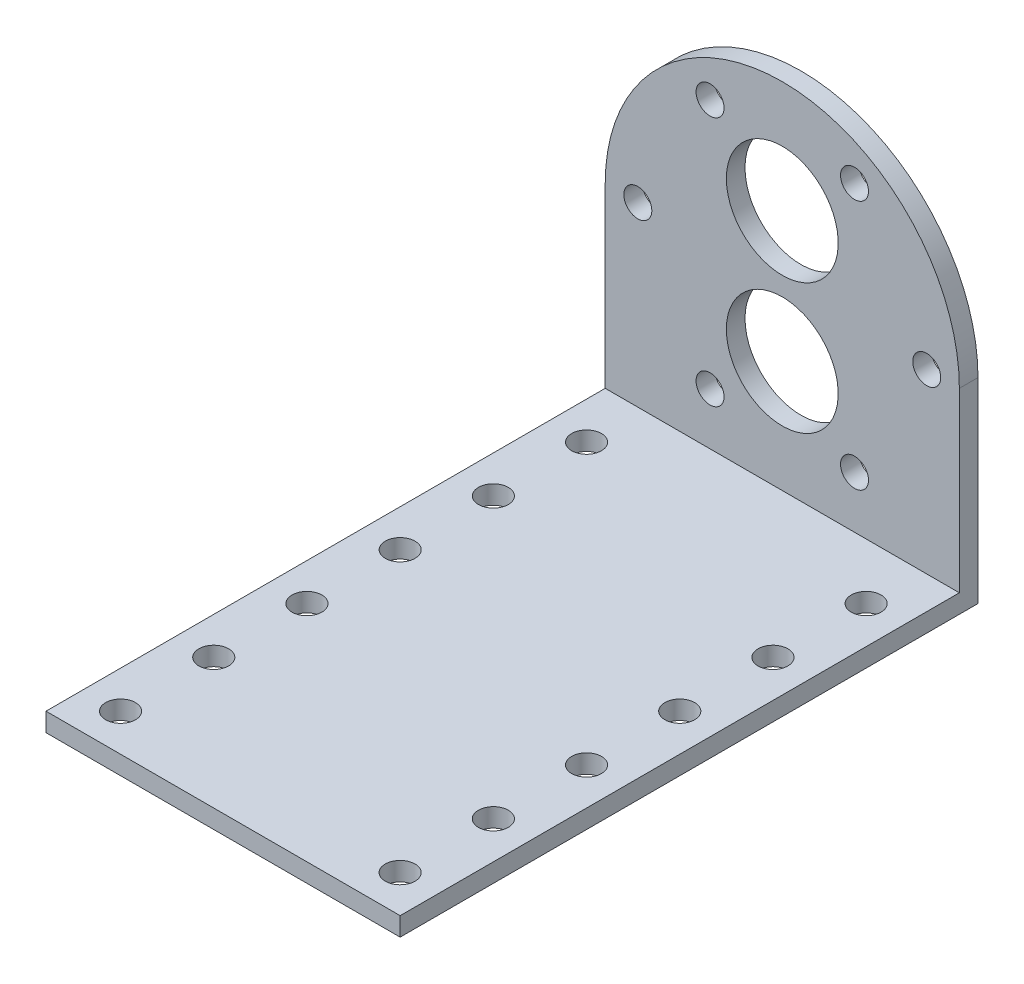
ISO-10303-21;
HEADER;
FILE_DESCRIPTION(('STEP AP214'),'2;1');
FILE_NAME('part.step','',(''),(''),'','','');
FILE_SCHEMA(('AUTOMOTIVE_DESIGN { 1 0 10303 214 1 1 1 1 }'));
ENDSEC;
DATA;
#1=APPLICATION_CONTEXT('core data for automotive mechanical design processes');
#2=APPLICATION_PROTOCOL_DEFINITION('international standard','automotive_design',2000,#1);
#3=PRODUCT_CONTEXT('',#1,'mechanical');
#4=PRODUCT('Part','Part','',(#3));
#5=PRODUCT_RELATED_PRODUCT_CATEGORY('part','',(#4));
#6=PRODUCT_DEFINITION_FORMATION('','',#4);
#7=PRODUCT_DEFINITION_CONTEXT('part definition',#1,'design');
#8=PRODUCT_DEFINITION('design','',#6,#7);
#9=PRODUCT_DEFINITION_SHAPE('','',#8);
#10=(LENGTH_UNIT() NAMED_UNIT(*) SI_UNIT(.MILLI.,.METRE.));
#11=(NAMED_UNIT(*) PLANE_ANGLE_UNIT() SI_UNIT($,.RADIAN.));
#12=(NAMED_UNIT(*) SI_UNIT($,.STERADIAN.) SOLID_ANGLE_UNIT());
#13=UNCERTAINTY_MEASURE_WITH_UNIT(LENGTH_MEASURE(1.E-05),#10,'distance_accuracy_value','');
#14=(GEOMETRIC_REPRESENTATION_CONTEXT(3) GLOBAL_UNCERTAINTY_ASSIGNED_CONTEXT((#13)) GLOBAL_UNIT_ASSIGNED_CONTEXT((#10,
#11,#12)) REPRESENTATION_CONTEXT('',''));
#15=CARTESIAN_POINT('',(0.,0.,0.));
#16=DIRECTION('',(0.,0.,1.));
#17=DIRECTION('',(1.,0.,0.));
#18=AXIS2_PLACEMENT_3D('',#15,#16,#17);
#19=CARTESIAN_POINT('',(0.,0.,2.));
#20=DIRECTION('',(0.,0.,-1.));
#21=DIRECTION('',(-1.,0.,0.));
#22=AXIS2_PLACEMENT_3D('',#19,#20,#21);
#23=CYLINDRICAL_SURFACE('',#22,19.);
#24=CARTESIAN_POINT('',(0.,0.,0.));
#25=DIRECTION('',(0.,0.,1.));
#26=DIRECTION('',(1.,0.,0.));
#27=AXIS2_PLACEMENT_3D('',#24,#25,#26);
#28=CIRCLE('',#27,19.);
#29=CARTESIAN_POINT('',(19.,0.,0.));
#30=VERTEX_POINT('',#29);
#31=CARTESIAN_POINT('',(-19.,0.,0.));
#32=VERTEX_POINT('',#31);
#33=EDGE_CURVE('E94',#30,#32,#28,.T.);
#34=ORIENTED_EDGE('',*,*,#33,.T.);
#35=DIRECTION('',(0.,0.,-1.));
#36=VECTOR('',#35,1.);
#37=CARTESIAN_POINT('',(-19.,0.,2.));
#38=LINE('',#37,#36);
#39=CARTESIAN_POINT('',(-19.,0.,2.));
#40=VERTEX_POINT('',#39);
#41=EDGE_CURVE('E11',#40,#32,#38,.T.);
#42=ORIENTED_EDGE('',*,*,#41,.F.);
#43=CARTESIAN_POINT('',(0.,0.,2.));
#44=DIRECTION('',(0.,0.,1.));
#45=DIRECTION('',(1.,0.,0.));
#46=AXIS2_PLACEMENT_3D('',#43,#44,#45);
#47=CIRCLE('',#46,19.);
#48=CARTESIAN_POINT('',(19.,0.,2.));
#49=VERTEX_POINT('',#48);
#50=EDGE_CURVE('E88',#49,#40,#47,.T.);
#51=ORIENTED_EDGE('',*,*,#50,.F.);
#52=DIRECTION('',(0.,0.,-1.));
#53=VECTOR('',#52,1.);
#54=CARTESIAN_POINT('',(19.,0.,2.));
#55=LINE('',#54,#53);
#56=EDGE_CURVE('E80',#49,#30,#55,.T.);
#57=ORIENTED_EDGE('',*,*,#56,.T.);
#58=EDGE_LOOP('',(#34,#42,#51,#57));
#59=FACE_BOUND('',#58,.T.);
#60=ADVANCED_FACE('F36',(#59),#23,.T.);
#61=CARTESIAN_POINT('',(-19.,0.,2.));
#62=DIRECTION('',(1.,0.,0.));
#63=DIRECTION('',(0.,0.,-1.));
#64=AXIS2_PLACEMENT_3D('',#61,#62,#63);
#65=PLANE('',#64);
#66=DIRECTION('',(0.,-1.,0.));
#67=VECTOR('',#66,1.);
#68=CARTESIAN_POINT('',(-19.,0.,0.));
#69=LINE('',#68,#67);
#70=CARTESIAN_POINT('',(-19.,-21.,0.));
#71=VERTEX_POINT('',#70);
#72=EDGE_CURVE('E97',#32,#71,#69,.T.);
#73=ORIENTED_EDGE('',*,*,#72,.T.);
#74=DIRECTION('',(0.,0.,-1.));
#75=VECTOR('',#74,1.);
#76=CARTESIAN_POINT('',(-19.,-21.,2.));
#77=LINE('',#76,#75);
#78=CARTESIAN_POINT('',(-19.,-21.,62.));
#79=VERTEX_POINT('',#78);
#80=EDGE_CURVE('E44',#79,#71,#77,.T.);
#81=ORIENTED_EDGE('',*,*,#80,.F.);
#82=DIRECTION('',(0.,-1.,0.));
#83=VECTOR('',#82,1.);
#84=CARTESIAN_POINT('',(-19.,-21.,62.));
#85=LINE('',#84,#83);
#86=CARTESIAN_POINT('',(-19.,-19.,62.));
#87=VERTEX_POINT('',#86);
#88=EDGE_CURVE('E122',#87,#79,#85,.T.);
#89=ORIENTED_EDGE('',*,*,#88,.F.);
#90=DIRECTION('',(0.,0.,-1.));
#91=VECTOR('',#90,1.);
#92=CARTESIAN_POINT('',(-19.,-19.,62.));
#93=LINE('',#92,#91);
#94=CARTESIAN_POINT('',(-19.,-19.,2.));
#95=VERTEX_POINT('',#94);
#96=EDGE_CURVE('E102',#87,#95,#93,.T.);
#97=ORIENTED_EDGE('',*,*,#96,.T.);
#98=DIRECTION('',(0.,-1.,0.));
#99=VECTOR('',#98,1.);
#100=CARTESIAN_POINT('',(-19.,0.,2.));
#101=LINE('',#100,#99);
#102=EDGE_CURVE('E111',#40,#95,#101,.T.);
#103=ORIENTED_EDGE('',*,*,#102,.F.);
#104=ORIENTED_EDGE('',*,*,#41,.T.);
#105=EDGE_LOOP('',(#73,#81,#89,#97,#103,#104));
#106=FACE_BOUND('',#105,.T.);
#107=ADVANCED_FACE('F303',(#106),#65,.F.);
#108=CARTESIAN_POINT('',(-19.,-21.,2.));
#109=DIRECTION('',(0.,1.,0.));
#110=DIRECTION('',(0.,0.,1.));
#111=AXIS2_PLACEMENT_3D('',#108,#109,#110);
#112=PLANE('',#111);
#113=CARTESIAN_POINT('',(15.,-21.,58.));
#114=DIRECTION('',(0.,1.,0.));
#115=DIRECTION('',(0.,0.,1.));
#116=AXIS2_PLACEMENT_3D('',#113,#114,#115);
#117=CIRCLE('',#116,1.6);
#118=CARTESIAN_POINT('',(15.,-21.,59.6));
#119=VERTEX_POINT('',#118);
#120=EDGE_CURVE('E207',#119,#119,#117,.T.);
#121=ORIENTED_EDGE('',*,*,#120,.T.);
#122=EDGE_LOOP('',(#121));
#123=FACE_BOUND('',#122,.T.);
#124=CARTESIAN_POINT('',(-15.,-21.,58.));
#125=DIRECTION('',(0.,1.,0.));
#126=DIRECTION('',(0.,0.,1.));
#127=AXIS2_PLACEMENT_3D('',#124,#125,#126);
#128=CIRCLE('',#127,1.6);
#129=CARTESIAN_POINT('',(-15.,-21.,59.6));
#130=VERTEX_POINT('',#129);
#131=EDGE_CURVE('E201',#130,#130,#128,.T.);
#132=ORIENTED_EDGE('',*,*,#131,.T.);
#133=EDGE_LOOP('',(#132));
#134=FACE_BOUND('',#133,.T.);
#135=CARTESIAN_POINT('',(15.,-21.,48.));
#136=DIRECTION('',(0.,1.,0.));
#137=DIRECTION('',(0.,0.,1.));
#138=AXIS2_PLACEMENT_3D('',#135,#136,#137);
#139=CIRCLE('',#138,1.6);
#140=CARTESIAN_POINT('',(15.,-21.,49.6));
#141=VERTEX_POINT('',#140);
#142=EDGE_CURVE('E195',#141,#141,#139,.T.);
#143=ORIENTED_EDGE('',*,*,#142,.T.);
#144=EDGE_LOOP('',(#143));
#145=FACE_BOUND('',#144,.T.);
#146=CARTESIAN_POINT('',(15.,-21.,38.));
#147=DIRECTION('',(0.,1.,0.));
#148=DIRECTION('',(0.,0.,1.));
#149=AXIS2_PLACEMENT_3D('',#146,#147,#148);
#150=CIRCLE('',#149,1.6);
#151=CARTESIAN_POINT('',(15.,-21.,39.6));
#152=VERTEX_POINT('',#151);
#153=EDGE_CURVE('E189',#152,#152,#150,.T.);
#154=ORIENTED_EDGE('',*,*,#153,.T.);
#155=EDGE_LOOP('',(#154));
#156=FACE_BOUND('',#155,.T.);
#157=CARTESIAN_POINT('',(15.,-21.,28.));
#158=DIRECTION('',(0.,1.,0.));
#159=DIRECTION('',(0.,0.,1.));
#160=AXIS2_PLACEMENT_3D('',#157,#158,#159);
#161=CIRCLE('',#160,1.6);
#162=CARTESIAN_POINT('',(15.,-21.,29.6));
#163=VERTEX_POINT('',#162);
#164=EDGE_CURVE('E183',#163,#163,#161,.T.);
#165=ORIENTED_EDGE('',*,*,#164,.T.);
#166=EDGE_LOOP('',(#165));
#167=FACE_BOUND('',#166,.T.);
#168=CARTESIAN_POINT('',(15.,-21.,18.));
#169=DIRECTION('',(0.,1.,0.));
#170=DIRECTION('',(0.,0.,1.));
#171=AXIS2_PLACEMENT_3D('',#168,#169,#170);
#172=CIRCLE('',#171,1.6);
#173=CARTESIAN_POINT('',(15.,-21.,19.6));
#174=VERTEX_POINT('',#173);
#175=EDGE_CURVE('E177',#174,#174,#172,.T.);
#176=ORIENTED_EDGE('',*,*,#175,.T.);
#177=EDGE_LOOP('',(#176));
#178=FACE_BOUND('',#177,.T.);
#179=CARTESIAN_POINT('',(15.,-21.,8.));
#180=DIRECTION('',(0.,1.,0.));
#181=DIRECTION('',(0.,0.,1.));
#182=AXIS2_PLACEMENT_3D('',#179,#180,#181);
#183=CIRCLE('',#182,1.6);
#184=CARTESIAN_POINT('',(15.,-21.,9.6));
#185=VERTEX_POINT('',#184);
#186=EDGE_CURVE('E171',#185,#185,#183,.T.);
#187=ORIENTED_EDGE('',*,*,#186,.T.);
#188=EDGE_LOOP('',(#187));
#189=FACE_BOUND('',#188,.T.);
#190=CARTESIAN_POINT('',(-15.,-21.,48.));
#191=DIRECTION('',(0.,1.,0.));
#192=DIRECTION('',(0.,0.,1.));
#193=AXIS2_PLACEMENT_3D('',#190,#191,#192);
#194=CIRCLE('',#193,1.6);
#195=CARTESIAN_POINT('',(-15.,-21.,49.6));
#196=VERTEX_POINT('',#195);
#197=EDGE_CURVE('E165',#196,#196,#194,.T.);
#198=ORIENTED_EDGE('',*,*,#197,.T.);
#199=EDGE_LOOP('',(#198));
#200=FACE_BOUND('',#199,.T.);
#201=CARTESIAN_POINT('',(-15.,-21.,28.));
#202=DIRECTION('',(0.,1.,0.));
#203=DIRECTION('',(0.,0.,1.));
#204=AXIS2_PLACEMENT_3D('',#201,#202,#203);
#205=CIRCLE('',#204,1.6);
#206=CARTESIAN_POINT('',(-15.,-21.,29.6));
#207=VERTEX_POINT('',#206);
#208=EDGE_CURVE('E159',#207,#207,#205,.T.);
#209=ORIENTED_EDGE('',*,*,#208,.T.);
#210=EDGE_LOOP('',(#209));
#211=FACE_BOUND('',#210,.T.);
#212=CARTESIAN_POINT('',(-15.,-21.,38.));
#213=DIRECTION('',(0.,1.,0.));
#214=DIRECTION('',(0.,0.,1.));
#215=AXIS2_PLACEMENT_3D('',#212,#213,#214);
#216=CIRCLE('',#215,1.6);
#217=CARTESIAN_POINT('',(-15.,-21.,39.6));
#218=VERTEX_POINT('',#217);
#219=EDGE_CURVE('E153',#218,#218,#216,.T.);
#220=ORIENTED_EDGE('',*,*,#219,.T.);
#221=EDGE_LOOP('',(#220));
#222=FACE_BOUND('',#221,.T.);
#223=CARTESIAN_POINT('',(-15.,-21.,8.));
#224=DIRECTION('',(0.,1.,0.));
#225=DIRECTION('',(0.,0.,1.));
#226=AXIS2_PLACEMENT_3D('',#223,#224,#225);
#227=CIRCLE('',#226,1.6);
#228=CARTESIAN_POINT('',(-15.,-21.,9.6));
#229=VERTEX_POINT('',#228);
#230=EDGE_CURVE('E147',#229,#229,#227,.T.);
#231=ORIENTED_EDGE('',*,*,#230,.T.);
#232=EDGE_LOOP('',(#231));
#233=FACE_BOUND('',#232,.T.);
#234=CARTESIAN_POINT('',(-15.,-21.,18.));
#235=DIRECTION('',(0.,1.,0.));
#236=DIRECTION('',(0.,0.,1.));
#237=AXIS2_PLACEMENT_3D('',#234,#235,#236);
#238=CIRCLE('',#237,1.6);
#239=CARTESIAN_POINT('',(-15.,-21.,19.6));
#240=VERTEX_POINT('',#239);
#241=EDGE_CURVE('E123',#240,#240,#238,.T.);
#242=ORIENTED_EDGE('',*,*,#241,.T.);
#243=EDGE_LOOP('',(#242));
#244=FACE_BOUND('',#243,.T.);
#245=DIRECTION('',(1.,0.,0.));
#246=VECTOR('',#245,1.);
#247=CARTESIAN_POINT('',(-19.,-21.,0.));
#248=LINE('',#247,#246);
#249=CARTESIAN_POINT('',(19.,-21.,0.));
#250=VERTEX_POINT('',#249);
#251=EDGE_CURVE('E89',#71,#250,#248,.T.);
#252=ORIENTED_EDGE('',*,*,#251,.T.);
#253=DIRECTION('',(0.,0.,-1.));
#254=VECTOR('',#253,1.);
#255=CARTESIAN_POINT('',(19.,-21.,2.));
#256=LINE('',#255,#254);
#257=CARTESIAN_POINT('',(19.,-21.,62.));
#258=VERTEX_POINT('',#257);
#259=EDGE_CURVE('E84',#258,#250,#256,.T.);
#260=ORIENTED_EDGE('',*,*,#259,.F.);
#261=DIRECTION('',(1.,0.,0.));
#262=VECTOR('',#261,1.);
#263=CARTESIAN_POINT('',(-19.,-21.,62.));
#264=LINE('',#263,#262);
#265=EDGE_CURVE('E137',#79,#258,#264,.T.);
#266=ORIENTED_EDGE('',*,*,#265,.F.);
#267=ORIENTED_EDGE('',*,*,#80,.T.);
#268=EDGE_LOOP('',(#252,#260,#266,#267));
#269=FACE_BOUND('',#268,.T.);
#270=ADVANCED_FACE('F307',(#123,#134,#145,#156,#167,#178,#189,#200,#211,#222,#233,#244,#269),
#112,.F.);
#271=CARTESIAN_POINT('',(19.,-21.,2.));
#272=DIRECTION('',(-1.,0.,0.));
#273=DIRECTION('',(0.,0.,1.));
#274=AXIS2_PLACEMENT_3D('',#271,#272,#273);
#275=PLANE('',#274);
#276=DIRECTION('',(0.,1.,0.));
#277=VECTOR('',#276,1.);
#278=CARTESIAN_POINT('',(19.,-21.,0.));
#279=LINE('',#278,#277);
#280=EDGE_CURVE('E77',#250,#30,#279,.T.);
#281=ORIENTED_EDGE('',*,*,#280,.T.);
#282=ORIENTED_EDGE('',*,*,#56,.F.);
#283=DIRECTION('',(0.,1.,0.));
#284=VECTOR('',#283,1.);
#285=CARTESIAN_POINT('',(19.,-21.,2.));
#286=LINE('',#285,#284);
#287=CARTESIAN_POINT('',(19.,-19.,2.));
#288=VERTEX_POINT('',#287);
#289=EDGE_CURVE('E57',#288,#49,#286,.T.);
#290=ORIENTED_EDGE('',*,*,#289,.F.);
#291=DIRECTION('',(0.,0.,-1.));
#292=VECTOR('',#291,1.);
#293=CARTESIAN_POINT('',(19.,-19.,62.));
#294=LINE('',#293,#292);
#295=CARTESIAN_POINT('',(19.,-19.,62.));
#296=VERTEX_POINT('',#295);
#297=EDGE_CURVE('E98',#296,#288,#294,.T.);
#298=ORIENTED_EDGE('',*,*,#297,.F.);
#299=DIRECTION('',(0.,1.,0.));
#300=VECTOR('',#299,1.);
#301=CARTESIAN_POINT('',(19.,-21.,62.));
#302=LINE('',#301,#300);
#303=EDGE_CURVE('E132',#258,#296,#302,.T.);
#304=ORIENTED_EDGE('',*,*,#303,.F.);
#305=ORIENTED_EDGE('',*,*,#259,.T.);
#306=EDGE_LOOP('',(#281,#282,#290,#298,#304,#305));
#307=FACE_BOUND('',#306,.T.);
#308=ADVANCED_FACE('F79',(#307),#275,.F.);
#309=CARTESIAN_POINT('',(0.,0.,2.));
#310=DIRECTION('',(0.,0.,1.));
#311=DIRECTION('',(1.,0.,0.));
#312=AXIS2_PLACEMENT_3D('',#309,#310,#311);
#313=PLANE('',#312);
#314=CARTESIAN_POINT('',(7.75000000000006,-13.4233937586588,2.));
#315=DIRECTION('',(0.,0.,-1.));
#316=DIRECTION('',(-1.,0.,0.));
#317=AXIS2_PLACEMENT_3D('',#314,#315,#316);
#318=CIRCLE('',#317,1.5);
#319=CARTESIAN_POINT('',(6.25000000000006,-13.4233937586588,2.));
#320=VERTEX_POINT('',#319);
#321=EDGE_CURVE('E258',#320,#320,#318,.T.);
#322=ORIENTED_EDGE('',*,*,#321,.T.);
#323=EDGE_LOOP('',(#322));
#324=FACE_BOUND('',#323,.T.);
#325=CARTESIAN_POINT('',(7.75000000000007,13.4233937586588,2.));
#326=DIRECTION('',(0.,0.,-1.));
#327=DIRECTION('',(-1.,0.,0.));
#328=AXIS2_PLACEMENT_3D('',#325,#326,#327);
#329=CIRCLE('',#328,1.5);
#330=CARTESIAN_POINT('',(6.25000000000007,13.4233937586588,2.));
#331=VERTEX_POINT('',#330);
#332=EDGE_CURVE('E252',#331,#331,#329,.T.);
#333=ORIENTED_EDGE('',*,*,#332,.T.);
#334=EDGE_LOOP('',(#333));
#335=FACE_BOUND('',#334,.T.);
#336=CARTESIAN_POINT('',(15.5,0.,2.));
#337=DIRECTION('',(0.,0.,-1.));
#338=DIRECTION('',(-1.,0.,0.));
#339=AXIS2_PLACEMENT_3D('',#336,#337,#338);
#340=CIRCLE('',#339,1.5);
#341=CARTESIAN_POINT('',(14.,0.,2.));
#342=VERTEX_POINT('',#341);
#343=EDGE_CURVE('E246',#342,#342,#340,.T.);
#344=ORIENTED_EDGE('',*,*,#343,.T.);
#345=EDGE_LOOP('',(#344));
#346=FACE_BOUND('',#345,.T.);
#347=CARTESIAN_POINT('',(-7.74999999999988,-13.4233937586589,2.));
#348=DIRECTION('',(0.,0.,-1.));
#349=DIRECTION('',(-1.,0.,0.));
#350=AXIS2_PLACEMENT_3D('',#347,#348,#349);
#351=CIRCLE('',#350,1.5);
#352=CARTESIAN_POINT('',(-9.24999999999988,-13.4233937586589,2.));
#353=VERTEX_POINT('',#352);
#354=EDGE_CURVE('E240',#353,#353,#351,.T.);
#355=ORIENTED_EDGE('',*,*,#354,.T.);
#356=EDGE_LOOP('',(#355));
#357=FACE_BOUND('',#356,.T.);
#358=CARTESIAN_POINT('',(-15.5,0.,2.));
#359=DIRECTION('',(0.,0.,-1.));
#360=DIRECTION('',(-1.,0.,0.));
#361=AXIS2_PLACEMENT_3D('',#358,#359,#360);
#362=CIRCLE('',#361,1.5);
#363=CARTESIAN_POINT('',(-17.,0.,2.));
#364=VERTEX_POINT('',#363);
#365=EDGE_CURVE('E234',#364,#364,#362,.T.);
#366=ORIENTED_EDGE('',*,*,#365,.T.);
#367=EDGE_LOOP('',(#366));
#368=FACE_BOUND('',#367,.T.);
#369=CARTESIAN_POINT('',(-7.75000000000006,13.4233937586588,2.));
#370=DIRECTION('',(0.,0.,-1.));
#371=DIRECTION('',(-1.,0.,0.));
#372=AXIS2_PLACEMENT_3D('',#369,#370,#371);
#373=CIRCLE('',#372,1.5);
#374=CARTESIAN_POINT('',(-9.25000000000006,13.4233937586588,2.));
#375=VERTEX_POINT('',#374);
#376=EDGE_CURVE('E228',#375,#375,#373,.T.);
#377=ORIENTED_EDGE('',*,*,#376,.T.);
#378=EDGE_LOOP('',(#377));
#379=FACE_BOUND('',#378,.T.);
#380=CARTESIAN_POINT('',(0.,7.,2.));
#381=DIRECTION('',(0.,0.,-1.));
#382=DIRECTION('',(-1.,0.,0.));
#383=AXIS2_PLACEMENT_3D('',#380,#381,#382);
#384=CIRCLE('',#383,6.);
#385=CARTESIAN_POINT('',(-6.,7.,2.));
#386=VERTEX_POINT('',#385);
#387=EDGE_CURVE('E222',#386,#386,#384,.T.);
#388=ORIENTED_EDGE('',*,*,#387,.T.);
#389=EDGE_LOOP('',(#388));
#390=FACE_BOUND('',#389,.T.);
#391=CARTESIAN_POINT('',(0.,-7.,2.));
#392=DIRECTION('',(0.,0.,-1.));
#393=DIRECTION('',(-1.,0.,0.));
#394=AXIS2_PLACEMENT_3D('',#391,#392,#393);
#395=CIRCLE('',#394,6.);
#396=CARTESIAN_POINT('',(-6.,-7.,2.));
#397=VERTEX_POINT('',#396);
#398=EDGE_CURVE('E213',#397,#397,#395,.T.);
#399=ORIENTED_EDGE('',*,*,#398,.T.);
#400=EDGE_LOOP('',(#399));
#401=FACE_BOUND('',#400,.T.);
#402=DIRECTION('',(-1.,0.,0.));
#403=VECTOR('',#402,1.);
#404=CARTESIAN_POINT('',(-19.,-19.,2.));
#405=LINE('',#404,#403);
#406=EDGE_CURVE('E52',#288,#95,#405,.T.);
#407=ORIENTED_EDGE('',*,*,#406,.F.);
#408=ORIENTED_EDGE('',*,*,#289,.T.);
#409=ORIENTED_EDGE('',*,*,#50,.T.);
#410=ORIENTED_EDGE('',*,*,#102,.T.);
#411=EDGE_LOOP('',(#407,#408,#409,#410));
#412=FACE_BOUND('',#411,.T.);
#413=ADVANCED_FACE('F269',(#324,#335,#346,#357,#368,#379,#390,#401,#412),#313,.T.);
#414=CARTESIAN_POINT('',(0.,0.,0.));
#415=DIRECTION('',(0.,0.,1.));
#416=DIRECTION('',(1.,0.,0.));
#417=AXIS2_PLACEMENT_3D('',#414,#415,#416);
#418=PLANE('',#417);
#419=CARTESIAN_POINT('',(7.75000000000006,-13.4233937586588,0.));
#420=DIRECTION('',(0.,0.,-1.));
#421=DIRECTION('',(-1.,0.,0.));
#422=AXIS2_PLACEMENT_3D('',#419,#420,#421);
#423=CIRCLE('',#422,1.5);
#424=CARTESIAN_POINT('',(6.25000000000006,-13.4233937586588,0.));
#425=VERTEX_POINT('',#424);
#426=EDGE_CURVE('E255',#425,#425,#423,.T.);
#427=ORIENTED_EDGE('',*,*,#426,.F.);
#428=EDGE_LOOP('',(#427));
#429=FACE_BOUND('',#428,.T.);
#430=CARTESIAN_POINT('',(7.75000000000007,13.4233937586588,0.));
#431=DIRECTION('',(0.,0.,-1.));
#432=DIRECTION('',(-1.,0.,0.));
#433=AXIS2_PLACEMENT_3D('',#430,#431,#432);
#434=CIRCLE('',#433,1.5);
#435=CARTESIAN_POINT('',(6.25000000000007,13.4233937586588,0.));
#436=VERTEX_POINT('',#435);
#437=EDGE_CURVE('E249',#436,#436,#434,.T.);
#438=ORIENTED_EDGE('',*,*,#437,.F.);
#439=EDGE_LOOP('',(#438));
#440=FACE_BOUND('',#439,.T.);
#441=CARTESIAN_POINT('',(15.5,0.,0.));
#442=DIRECTION('',(0.,0.,-1.));
#443=DIRECTION('',(-1.,0.,0.));
#444=AXIS2_PLACEMENT_3D('',#441,#442,#443);
#445=CIRCLE('',#444,1.5);
#446=CARTESIAN_POINT('',(14.,0.,0.));
#447=VERTEX_POINT('',#446);
#448=EDGE_CURVE('E243',#447,#447,#445,.T.);
#449=ORIENTED_EDGE('',*,*,#448,.F.);
#450=EDGE_LOOP('',(#449));
#451=FACE_BOUND('',#450,.T.);
#452=CARTESIAN_POINT('',(-7.74999999999988,-13.4233937586589,0.));
#453=DIRECTION('',(0.,0.,-1.));
#454=DIRECTION('',(-1.,0.,0.));
#455=AXIS2_PLACEMENT_3D('',#452,#453,#454);
#456=CIRCLE('',#455,1.5);
#457=CARTESIAN_POINT('',(-9.24999999999988,-13.4233937586589,0.));
#458=VERTEX_POINT('',#457);
#459=EDGE_CURVE('E237',#458,#458,#456,.T.);
#460=ORIENTED_EDGE('',*,*,#459,.F.);
#461=EDGE_LOOP('',(#460));
#462=FACE_BOUND('',#461,.T.);
#463=CARTESIAN_POINT('',(-15.5,0.,0.));
#464=DIRECTION('',(0.,0.,-1.));
#465=DIRECTION('',(-1.,0.,0.));
#466=AXIS2_PLACEMENT_3D('',#463,#464,#465);
#467=CIRCLE('',#466,1.5);
#468=CARTESIAN_POINT('',(-17.,0.,0.));
#469=VERTEX_POINT('',#468);
#470=EDGE_CURVE('E231',#469,#469,#467,.T.);
#471=ORIENTED_EDGE('',*,*,#470,.F.);
#472=EDGE_LOOP('',(#471));
#473=FACE_BOUND('',#472,.T.);
#474=CARTESIAN_POINT('',(-7.75000000000006,13.4233937586588,0.));
#475=DIRECTION('',(0.,0.,-1.));
#476=DIRECTION('',(-1.,0.,0.));
#477=AXIS2_PLACEMENT_3D('',#474,#475,#476);
#478=CIRCLE('',#477,1.5);
#479=CARTESIAN_POINT('',(-9.25000000000006,13.4233937586588,0.));
#480=VERTEX_POINT('',#479);
#481=EDGE_CURVE('E225',#480,#480,#478,.T.);
#482=ORIENTED_EDGE('',*,*,#481,.F.);
#483=EDGE_LOOP('',(#482));
#484=FACE_BOUND('',#483,.T.);
#485=CARTESIAN_POINT('',(0.,7.,0.));
#486=DIRECTION('',(0.,0.,-1.));
#487=DIRECTION('',(-1.,0.,0.));
#488=AXIS2_PLACEMENT_3D('',#485,#486,#487);
#489=CIRCLE('',#488,6.);
#490=CARTESIAN_POINT('',(-6.,7.,0.));
#491=VERTEX_POINT('',#490);
#492=EDGE_CURVE('E219',#491,#491,#489,.T.);
#493=ORIENTED_EDGE('',*,*,#492,.F.);
#494=EDGE_LOOP('',(#493));
#495=FACE_BOUND('',#494,.T.);
#496=CARTESIAN_POINT('',(0.,-7.,0.));
#497=DIRECTION('',(0.,0.,-1.));
#498=DIRECTION('',(-1.,0.,0.));
#499=AXIS2_PLACEMENT_3D('',#496,#497,#498);
#500=CIRCLE('',#499,6.);
#501=CARTESIAN_POINT('',(-6.,-7.,0.));
#502=VERTEX_POINT('',#501);
#503=EDGE_CURVE('E216',#502,#502,#500,.T.);
#504=ORIENTED_EDGE('',*,*,#503,.F.);
#505=EDGE_LOOP('',(#504));
#506=FACE_BOUND('',#505,.T.);
#507=ORIENTED_EDGE('',*,*,#33,.F.);
#508=ORIENTED_EDGE('',*,*,#280,.F.);
#509=ORIENTED_EDGE('',*,*,#251,.F.);
#510=ORIENTED_EDGE('',*,*,#72,.F.);
#511=EDGE_LOOP('',(#507,#508,#509,#510));
#512=FACE_BOUND('',#511,.T.);
#513=ADVANCED_FACE('F96',(#429,#440,#451,#462,#473,#484,#495,#506,#512),#418,.F.);
#514=CARTESIAN_POINT('',(-19.,-19.,62.));
#515=DIRECTION('',(0.,-1.,0.));
#516=DIRECTION('',(0.,0.,-1.));
#517=AXIS2_PLACEMENT_3D('',#514,#515,#516);
#518=PLANE('',#517);
#519=CARTESIAN_POINT('',(15.,-19.,58.));
#520=DIRECTION('',(0.,1.,0.));
#521=DIRECTION('',(0.,0.,1.));
#522=AXIS2_PLACEMENT_3D('',#519,#520,#521);
#523=CIRCLE('',#522,1.6);
#524=CARTESIAN_POINT('',(15.,-19.,59.6));
#525=VERTEX_POINT('',#524);
#526=EDGE_CURVE('E210',#525,#525,#523,.T.);
#527=ORIENTED_EDGE('',*,*,#526,.F.);
#528=EDGE_LOOP('',(#527));
#529=FACE_BOUND('',#528,.T.);
#530=CARTESIAN_POINT('',(-15.,-19.,58.));
#531=DIRECTION('',(0.,1.,0.));
#532=DIRECTION('',(0.,0.,1.));
#533=AXIS2_PLACEMENT_3D('',#530,#531,#532);
#534=CIRCLE('',#533,1.6);
#535=CARTESIAN_POINT('',(-15.,-19.,59.6));
#536=VERTEX_POINT('',#535);
#537=EDGE_CURVE('E204',#536,#536,#534,.T.);
#538=ORIENTED_EDGE('',*,*,#537,.F.);
#539=EDGE_LOOP('',(#538));
#540=FACE_BOUND('',#539,.T.);
#541=CARTESIAN_POINT('',(15.,-19.,48.));
#542=DIRECTION('',(0.,1.,0.));
#543=DIRECTION('',(0.,0.,1.));
#544=AXIS2_PLACEMENT_3D('',#541,#542,#543);
#545=CIRCLE('',#544,1.6);
#546=CARTESIAN_POINT('',(15.,-19.,49.6));
#547=VERTEX_POINT('',#546);
#548=EDGE_CURVE('E198',#547,#547,#545,.T.);
#549=ORIENTED_EDGE('',*,*,#548,.F.);
#550=EDGE_LOOP('',(#549));
#551=FACE_BOUND('',#550,.T.);
#552=CARTESIAN_POINT('',(15.,-19.,38.));
#553=DIRECTION('',(0.,1.,0.));
#554=DIRECTION('',(0.,0.,1.));
#555=AXIS2_PLACEMENT_3D('',#552,#553,#554);
#556=CIRCLE('',#555,1.6);
#557=CARTESIAN_POINT('',(15.,-19.,39.6));
#558=VERTEX_POINT('',#557);
#559=EDGE_CURVE('E192',#558,#558,#556,.T.);
#560=ORIENTED_EDGE('',*,*,#559,.F.);
#561=EDGE_LOOP('',(#560));
#562=FACE_BOUND('',#561,.T.);
#563=CARTESIAN_POINT('',(15.,-19.,28.));
#564=DIRECTION('',(0.,1.,0.));
#565=DIRECTION('',(0.,0.,1.));
#566=AXIS2_PLACEMENT_3D('',#563,#564,#565);
#567=CIRCLE('',#566,1.6);
#568=CARTESIAN_POINT('',(15.,-19.,29.6));
#569=VERTEX_POINT('',#568);
#570=EDGE_CURVE('E186',#569,#569,#567,.T.);
#571=ORIENTED_EDGE('',*,*,#570,.F.);
#572=EDGE_LOOP('',(#571));
#573=FACE_BOUND('',#572,.T.);
#574=CARTESIAN_POINT('',(15.,-19.,18.));
#575=DIRECTION('',(0.,1.,0.));
#576=DIRECTION('',(0.,0.,1.));
#577=AXIS2_PLACEMENT_3D('',#574,#575,#576);
#578=CIRCLE('',#577,1.6);
#579=CARTESIAN_POINT('',(15.,-19.,19.6));
#580=VERTEX_POINT('',#579);
#581=EDGE_CURVE('E180',#580,#580,#578,.T.);
#582=ORIENTED_EDGE('',*,*,#581,.F.);
#583=EDGE_LOOP('',(#582));
#584=FACE_BOUND('',#583,.T.);
#585=CARTESIAN_POINT('',(15.,-19.,8.));
#586=DIRECTION('',(0.,1.,0.));
#587=DIRECTION('',(0.,0.,1.));
#588=AXIS2_PLACEMENT_3D('',#585,#586,#587);
#589=CIRCLE('',#588,1.6);
#590=CARTESIAN_POINT('',(15.,-19.,9.6));
#591=VERTEX_POINT('',#590);
#592=EDGE_CURVE('E174',#591,#591,#589,.T.);
#593=ORIENTED_EDGE('',*,*,#592,.F.);
#594=EDGE_LOOP('',(#593));
#595=FACE_BOUND('',#594,.T.);
#596=CARTESIAN_POINT('',(-15.,-19.,48.));
#597=DIRECTION('',(0.,1.,0.));
#598=DIRECTION('',(0.,0.,1.));
#599=AXIS2_PLACEMENT_3D('',#596,#597,#598);
#600=CIRCLE('',#599,1.6);
#601=CARTESIAN_POINT('',(-15.,-19.,49.6));
#602=VERTEX_POINT('',#601);
#603=EDGE_CURVE('E168',#602,#602,#600,.T.);
#604=ORIENTED_EDGE('',*,*,#603,.F.);
#605=EDGE_LOOP('',(#604));
#606=FACE_BOUND('',#605,.T.);
#607=CARTESIAN_POINT('',(-15.,-19.,28.));
#608=DIRECTION('',(0.,1.,0.));
#609=DIRECTION('',(0.,0.,1.));
#610=AXIS2_PLACEMENT_3D('',#607,#608,#609);
#611=CIRCLE('',#610,1.6);
#612=CARTESIAN_POINT('',(-15.,-19.,29.6));
#613=VERTEX_POINT('',#612);
#614=EDGE_CURVE('E162',#613,#613,#611,.T.);
#615=ORIENTED_EDGE('',*,*,#614,.F.);
#616=EDGE_LOOP('',(#615));
#617=FACE_BOUND('',#616,.T.);
#618=CARTESIAN_POINT('',(-15.,-19.,38.));
#619=DIRECTION('',(0.,1.,0.));
#620=DIRECTION('',(0.,0.,1.));
#621=AXIS2_PLACEMENT_3D('',#618,#619,#620);
#622=CIRCLE('',#621,1.6);
#623=CARTESIAN_POINT('',(-15.,-19.,39.6));
#624=VERTEX_POINT('',#623);
#625=EDGE_CURVE('E156',#624,#624,#622,.T.);
#626=ORIENTED_EDGE('',*,*,#625,.F.);
#627=EDGE_LOOP('',(#626));
#628=FACE_BOUND('',#627,.T.);
#629=CARTESIAN_POINT('',(-15.,-19.,8.));
#630=DIRECTION('',(0.,1.,0.));
#631=DIRECTION('',(0.,0.,1.));
#632=AXIS2_PLACEMENT_3D('',#629,#630,#631);
#633=CIRCLE('',#632,1.6);
#634=CARTESIAN_POINT('',(-15.,-19.,9.6));
#635=VERTEX_POINT('',#634);
#636=EDGE_CURVE('E150',#635,#635,#633,.T.);
#637=ORIENTED_EDGE('',*,*,#636,.F.);
#638=EDGE_LOOP('',(#637));
#639=FACE_BOUND('',#638,.T.);
#640=CARTESIAN_POINT('',(-15.,-19.,18.));
#641=DIRECTION('',(0.,1.,0.));
#642=DIRECTION('',(0.,0.,1.));
#643=AXIS2_PLACEMENT_3D('',#640,#641,#642);
#644=CIRCLE('',#643,1.6);
#645=CARTESIAN_POINT('',(-15.,-19.,19.6));
#646=VERTEX_POINT('',#645);
#647=EDGE_CURVE('E144',#646,#646,#644,.T.);
#648=ORIENTED_EDGE('',*,*,#647,.F.);
#649=EDGE_LOOP('',(#648));
#650=FACE_BOUND('',#649,.T.);
#651=ORIENTED_EDGE('',*,*,#406,.T.);
#652=ORIENTED_EDGE('',*,*,#96,.F.);
#653=DIRECTION('',(-1.,0.,0.));
#654=VECTOR('',#653,1.);
#655=CARTESIAN_POINT('',(-19.,-19.,62.));
#656=LINE('',#655,#654);
#657=EDGE_CURVE('E119',#296,#87,#656,.T.);
#658=ORIENTED_EDGE('',*,*,#657,.F.);
#659=ORIENTED_EDGE('',*,*,#297,.T.);
#660=EDGE_LOOP('',(#651,#652,#658,#659));
#661=FACE_BOUND('',#660,.T.);
#662=ADVANCED_FACE('F268',(#529,#540,#551,#562,#573,#584,#595,#606,#617,#628,#639,#650,#661),
#518,.F.);
#663=CARTESIAN_POINT('',(0.,0.,62.));
#664=DIRECTION('',(0.,0.,-1.));
#665=DIRECTION('',(-1.,0.,0.));
#666=AXIS2_PLACEMENT_3D('',#663,#664,#665);
#667=PLANE('',#666);
#668=ORIENTED_EDGE('',*,*,#88,.T.);
#669=ORIENTED_EDGE('',*,*,#265,.T.);
#670=ORIENTED_EDGE('',*,*,#303,.T.);
#671=ORIENTED_EDGE('',*,*,#657,.T.);
#672=EDGE_LOOP('',(#668,#669,#670,#671));
#673=FACE_BOUND('',#672,.T.);
#674=ADVANCED_FACE('F321',(#673),#667,.F.);
#675=CARTESIAN_POINT('',(-15.,-21.,18.));
#676=DIRECTION('',(0.,1.,0.));
#677=DIRECTION('',(0.,0.,1.));
#678=AXIS2_PLACEMENT_3D('',#675,#676,#677);
#679=CYLINDRICAL_SURFACE('',#678,1.6);
#680=ORIENTED_EDGE('',*,*,#241,.F.);
#681=EDGE_LOOP('',(#680));
#682=FACE_BOUND('',#681,.T.);
#683=ORIENTED_EDGE('',*,*,#647,.T.);
#684=EDGE_LOOP('',(#683));
#685=FACE_BOUND('',#684,.T.);
#686=ADVANCED_FACE('F325',(#682,#685),#679,.F.);
#687=CARTESIAN_POINT('',(-15.,-21.,8.));
#688=DIRECTION('',(0.,1.,0.));
#689=DIRECTION('',(0.,0.,1.));
#690=AXIS2_PLACEMENT_3D('',#687,#688,#689);
#691=CYLINDRICAL_SURFACE('',#690,1.6);
#692=ORIENTED_EDGE('',*,*,#230,.F.);
#693=EDGE_LOOP('',(#692));
#694=FACE_BOUND('',#693,.T.);
#695=ORIENTED_EDGE('',*,*,#636,.T.);
#696=EDGE_LOOP('',(#695));
#697=FACE_BOUND('',#696,.T.);
#698=ADVANCED_FACE('F328',(#694,#697),#691,.F.);
#699=CARTESIAN_POINT('',(-15.,-21.,38.));
#700=DIRECTION('',(0.,1.,0.));
#701=DIRECTION('',(0.,0.,1.));
#702=AXIS2_PLACEMENT_3D('',#699,#700,#701);
#703=CYLINDRICAL_SURFACE('',#702,1.6);
#704=ORIENTED_EDGE('',*,*,#219,.F.);
#705=EDGE_LOOP('',(#704));
#706=FACE_BOUND('',#705,.T.);
#707=ORIENTED_EDGE('',*,*,#625,.T.);
#708=EDGE_LOOP('',(#707));
#709=FACE_BOUND('',#708,.T.);
#710=ADVANCED_FACE('F332',(#706,#709),#703,.F.);
#711=CARTESIAN_POINT('',(-15.,-21.,28.));
#712=DIRECTION('',(0.,1.,0.));
#713=DIRECTION('',(0.,0.,1.));
#714=AXIS2_PLACEMENT_3D('',#711,#712,#713);
#715=CYLINDRICAL_SURFACE('',#714,1.6);
#716=ORIENTED_EDGE('',*,*,#208,.F.);
#717=EDGE_LOOP('',(#716));
#718=FACE_BOUND('',#717,.T.);
#719=ORIENTED_EDGE('',*,*,#614,.T.);
#720=EDGE_LOOP('',(#719));
#721=FACE_BOUND('',#720,.T.);
#722=ADVANCED_FACE('F336',(#718,#721),#715,.F.);
#723=CARTESIAN_POINT('',(-15.,-21.,48.));
#724=DIRECTION('',(0.,1.,0.));
#725=DIRECTION('',(0.,0.,1.));
#726=AXIS2_PLACEMENT_3D('',#723,#724,#725);
#727=CYLINDRICAL_SURFACE('',#726,1.6);
#728=ORIENTED_EDGE('',*,*,#197,.F.);
#729=EDGE_LOOP('',(#728));
#730=FACE_BOUND('',#729,.T.);
#731=ORIENTED_EDGE('',*,*,#603,.T.);
#732=EDGE_LOOP('',(#731));
#733=FACE_BOUND('',#732,.T.);
#734=ADVANCED_FACE('F340',(#730,#733),#727,.F.);
#735=CARTESIAN_POINT('',(15.,-21.,8.));
#736=DIRECTION('',(0.,1.,0.));
#737=DIRECTION('',(0.,0.,1.));
#738=AXIS2_PLACEMENT_3D('',#735,#736,#737);
#739=CYLINDRICAL_SURFACE('',#738,1.6);
#740=ORIENTED_EDGE('',*,*,#186,.F.);
#741=EDGE_LOOP('',(#740));
#742=FACE_BOUND('',#741,.T.);
#743=ORIENTED_EDGE('',*,*,#592,.T.);
#744=EDGE_LOOP('',(#743));
#745=FACE_BOUND('',#744,.T.);
#746=ADVANCED_FACE('F344',(#742,#745),#739,.F.);
#747=CARTESIAN_POINT('',(15.,-21.,18.));
#748=DIRECTION('',(0.,1.,0.));
#749=DIRECTION('',(0.,0.,1.));
#750=AXIS2_PLACEMENT_3D('',#747,#748,#749);
#751=CYLINDRICAL_SURFACE('',#750,1.6);
#752=ORIENTED_EDGE('',*,*,#175,.F.);
#753=EDGE_LOOP('',(#752));
#754=FACE_BOUND('',#753,.T.);
#755=ORIENTED_EDGE('',*,*,#581,.T.);
#756=EDGE_LOOP('',(#755));
#757=FACE_BOUND('',#756,.T.);
#758=ADVANCED_FACE('F348',(#754,#757),#751,.F.);
#759=CARTESIAN_POINT('',(15.,-21.,28.));
#760=DIRECTION('',(0.,1.,0.));
#761=DIRECTION('',(0.,0.,1.));
#762=AXIS2_PLACEMENT_3D('',#759,#760,#761);
#763=CYLINDRICAL_SURFACE('',#762,1.6);
#764=ORIENTED_EDGE('',*,*,#164,.F.);
#765=EDGE_LOOP('',(#764));
#766=FACE_BOUND('',#765,.T.);
#767=ORIENTED_EDGE('',*,*,#570,.T.);
#768=EDGE_LOOP('',(#767));
#769=FACE_BOUND('',#768,.T.);
#770=ADVANCED_FACE('F352',(#766,#769),#763,.F.);
#771=CARTESIAN_POINT('',(15.,-21.,38.));
#772=DIRECTION('',(0.,1.,0.));
#773=DIRECTION('',(0.,0.,1.));
#774=AXIS2_PLACEMENT_3D('',#771,#772,#773);
#775=CYLINDRICAL_SURFACE('',#774,1.6);
#776=ORIENTED_EDGE('',*,*,#153,.F.);
#777=EDGE_LOOP('',(#776));
#778=FACE_BOUND('',#777,.T.);
#779=ORIENTED_EDGE('',*,*,#559,.T.);
#780=EDGE_LOOP('',(#779));
#781=FACE_BOUND('',#780,.T.);
#782=ADVANCED_FACE('F356',(#778,#781),#775,.F.);
#783=CARTESIAN_POINT('',(15.,-21.,48.));
#784=DIRECTION('',(0.,1.,0.));
#785=DIRECTION('',(0.,0.,1.));
#786=AXIS2_PLACEMENT_3D('',#783,#784,#785);
#787=CYLINDRICAL_SURFACE('',#786,1.6);
#788=ORIENTED_EDGE('',*,*,#142,.F.);
#789=EDGE_LOOP('',(#788));
#790=FACE_BOUND('',#789,.T.);
#791=ORIENTED_EDGE('',*,*,#548,.T.);
#792=EDGE_LOOP('',(#791));
#793=FACE_BOUND('',#792,.T.);
#794=ADVANCED_FACE('F360',(#790,#793),#787,.F.);
#795=CARTESIAN_POINT('',(-15.,-21.,58.));
#796=DIRECTION('',(0.,1.,0.));
#797=DIRECTION('',(0.,0.,1.));
#798=AXIS2_PLACEMENT_3D('',#795,#796,#797);
#799=CYLINDRICAL_SURFACE('',#798,1.6);
#800=ORIENTED_EDGE('',*,*,#131,.F.);
#801=EDGE_LOOP('',(#800));
#802=FACE_BOUND('',#801,.T.);
#803=ORIENTED_EDGE('',*,*,#537,.T.);
#804=EDGE_LOOP('',(#803));
#805=FACE_BOUND('',#804,.T.);
#806=ADVANCED_FACE('F298',(#802,#805),#799,.F.);
#807=CARTESIAN_POINT('',(15.,-21.,58.));
#808=DIRECTION('',(0.,1.,0.));
#809=DIRECTION('',(0.,0.,1.));
#810=AXIS2_PLACEMENT_3D('',#807,#808,#809);
#811=CYLINDRICAL_SURFACE('',#810,1.6);
#812=ORIENTED_EDGE('',*,*,#120,.F.);
#813=EDGE_LOOP('',(#812));
#814=FACE_BOUND('',#813,.T.);
#815=ORIENTED_EDGE('',*,*,#526,.T.);
#816=EDGE_LOOP('',(#815));
#817=FACE_BOUND('',#816,.T.);
#818=ADVANCED_FACE('F288',(#814,#817),#811,.F.);
#819=CARTESIAN_POINT('',(0.,-7.,2.));
#820=DIRECTION('',(0.,0.,-1.));
#821=DIRECTION('',(-1.,0.,0.));
#822=AXIS2_PLACEMENT_3D('',#819,#820,#821);
#823=CYLINDRICAL_SURFACE('',#822,6.);
#824=ORIENTED_EDGE('',*,*,#398,.F.);
#825=EDGE_LOOP('',(#824));
#826=FACE_BOUND('',#825,.T.);
#827=ORIENTED_EDGE('',*,*,#503,.T.);
#828=EDGE_LOOP('',(#827));
#829=FACE_BOUND('',#828,.T.);
#830=ADVANCED_FACE('F285',(#826,#829),#823,.F.);
#831=CARTESIAN_POINT('',(0.,7.,2.));
#832=DIRECTION('',(0.,0.,-1.));
#833=DIRECTION('',(-1.,0.,0.));
#834=AXIS2_PLACEMENT_3D('',#831,#832,#833);
#835=CYLINDRICAL_SURFACE('',#834,6.);
#836=ORIENTED_EDGE('',*,*,#387,.F.);
#837=EDGE_LOOP('',(#836));
#838=FACE_BOUND('',#837,.T.);
#839=ORIENTED_EDGE('',*,*,#492,.T.);
#840=EDGE_LOOP('',(#839));
#841=FACE_BOUND('',#840,.T.);
#842=ADVANCED_FACE('F287',(#838,#841),#835,.F.);
#843=CARTESIAN_POINT('',(-7.75000000000006,13.4233937586588,2.));
#844=DIRECTION('',(0.,0.,-1.));
#845=DIRECTION('',(-1.,0.,0.));
#846=AXIS2_PLACEMENT_3D('',#843,#844,#845);
#847=CYLINDRICAL_SURFACE('',#846,1.5);
#848=ORIENTED_EDGE('',*,*,#376,.F.);
#849=EDGE_LOOP('',(#848));
#850=FACE_BOUND('',#849,.T.);
#851=ORIENTED_EDGE('',*,*,#481,.T.);
#852=EDGE_LOOP('',(#851));
#853=FACE_BOUND('',#852,.T.);
#854=ADVANCED_FACE('F295',(#850,#853),#847,.F.);
#855=CARTESIAN_POINT('',(-15.5,0.,2.));
#856=DIRECTION('',(0.,0.,-1.));
#857=DIRECTION('',(-1.,0.,0.));
#858=AXIS2_PLACEMENT_3D('',#855,#856,#857);
#859=CYLINDRICAL_SURFACE('',#858,1.5);
#860=ORIENTED_EDGE('',*,*,#365,.F.);
#861=EDGE_LOOP('',(#860));
#862=FACE_BOUND('',#861,.T.);
#863=ORIENTED_EDGE('',*,*,#470,.T.);
#864=EDGE_LOOP('',(#863));
#865=FACE_BOUND('',#864,.T.);
#866=ADVANCED_FACE('F473',(#862,#865),#859,.F.);
#867=CARTESIAN_POINT('',(-7.74999999999988,-13.4233937586589,2.));
#868=DIRECTION('',(0.,0.,-1.));
#869=DIRECTION('',(-1.,0.,0.));
#870=AXIS2_PLACEMENT_3D('',#867,#868,#869);
#871=CYLINDRICAL_SURFACE('',#870,1.5);
#872=ORIENTED_EDGE('',*,*,#354,.F.);
#873=EDGE_LOOP('',(#872));
#874=FACE_BOUND('',#873,.T.);
#875=ORIENTED_EDGE('',*,*,#459,.T.);
#876=EDGE_LOOP('',(#875));
#877=FACE_BOUND('',#876,.T.);
#878=ADVANCED_FACE('F483',(#874,#877),#871,.F.);
#879=CARTESIAN_POINT('',(15.5,0.,2.));
#880=DIRECTION('',(0.,0.,-1.));
#881=DIRECTION('',(-1.,0.,0.));
#882=AXIS2_PLACEMENT_3D('',#879,#880,#881);
#883=CYLINDRICAL_SURFACE('',#882,1.5);
#884=ORIENTED_EDGE('',*,*,#343,.F.);
#885=EDGE_LOOP('',(#884));
#886=FACE_BOUND('',#885,.T.);
#887=ORIENTED_EDGE('',*,*,#448,.T.);
#888=EDGE_LOOP('',(#887));
#889=FACE_BOUND('',#888,.T.);
#890=ADVANCED_FACE('F493',(#886,#889),#883,.F.);
#891=CARTESIAN_POINT('',(7.75000000000007,13.4233937586588,2.));
#892=DIRECTION('',(0.,0.,-1.));
#893=DIRECTION('',(-1.,0.,0.));
#894=AXIS2_PLACEMENT_3D('',#891,#892,#893);
#895=CYLINDRICAL_SURFACE('',#894,1.5);
#896=ORIENTED_EDGE('',*,*,#332,.F.);
#897=EDGE_LOOP('',(#896));
#898=FACE_BOUND('',#897,.T.);
#899=ORIENTED_EDGE('',*,*,#437,.T.);
#900=EDGE_LOOP('',(#899));
#901=FACE_BOUND('',#900,.T.);
#902=ADVANCED_FACE('F503',(#898,#901),#895,.F.);
#903=CARTESIAN_POINT('',(7.75000000000006,-13.4233937586588,2.));
#904=DIRECTION('',(0.,0.,-1.));
#905=DIRECTION('',(-1.,0.,0.));
#906=AXIS2_PLACEMENT_3D('',#903,#904,#905);
#907=CYLINDRICAL_SURFACE('',#906,1.5);
#908=ORIENTED_EDGE('',*,*,#321,.F.);
#909=EDGE_LOOP('',(#908));
#910=FACE_BOUND('',#909,.T.);
#911=ORIENTED_EDGE('',*,*,#426,.T.);
#912=EDGE_LOOP('',(#911));
#913=FACE_BOUND('',#912,.T.);
#914=ADVANCED_FACE('F264',(#910,#913),#907,.F.);
#915=CLOSED_SHELL('',(#60,#107,#270,#308,#413,#513,#662,#674,#686,#698,#710,#722,#734,#746,#758,
#770,#782,#794,#806,#818,#830,#842,#854,#866,#878,#890,#902,#914));
#916=MANIFOLD_SOLID_BREP('B2',#915);
#917=ADVANCED_BREP_SHAPE_REPRESENTATION('',(#18,#916),#14);
#918=SHAPE_DEFINITION_REPRESENTATION(#9,#917);
ENDSEC;
END-ISO-10303-21;
